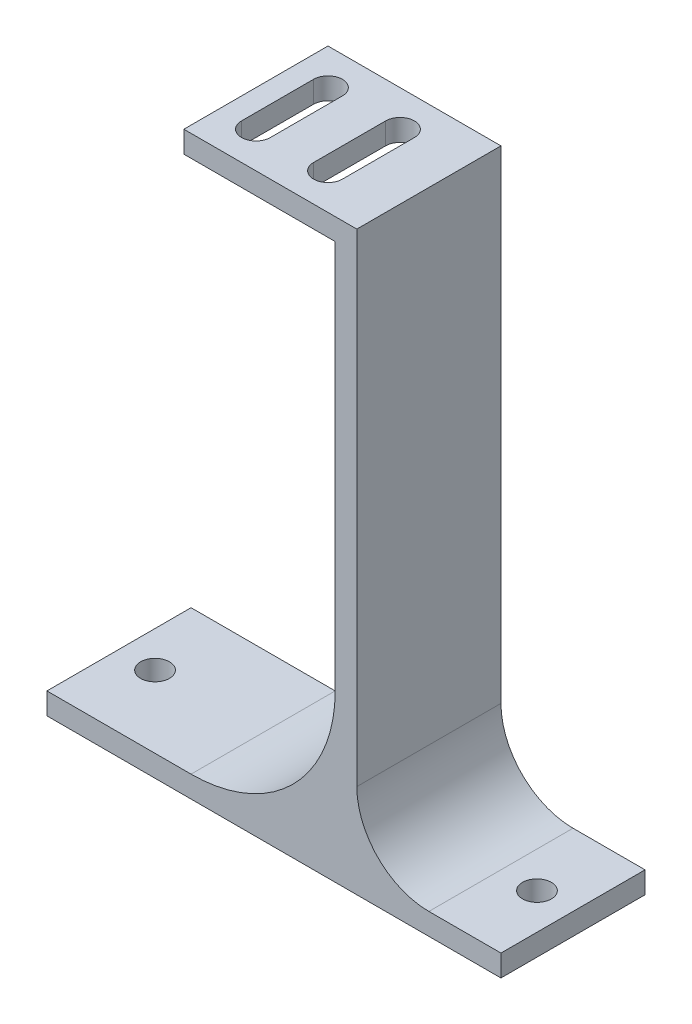
ISO-10303-21;
HEADER;
FILE_DESCRIPTION(('STEP AP214'),'2;1');
FILE_NAME('part.step','',(''),(''),'','','');
FILE_SCHEMA(('AUTOMOTIVE_DESIGN { 1 0 10303 214 1 1 1 1 }'));
ENDSEC;
DATA;
#1=APPLICATION_CONTEXT('core data for automotive mechanical design processes');
#2=APPLICATION_PROTOCOL_DEFINITION('international standard','automotive_design',2000,#1);
#3=PRODUCT_CONTEXT('',#1,'mechanical');
#4=PRODUCT('Part','Part','',(#3));
#5=PRODUCT_RELATED_PRODUCT_CATEGORY('part','',(#4));
#6=PRODUCT_DEFINITION_FORMATION('','',#4);
#7=PRODUCT_DEFINITION_CONTEXT('part definition',#1,'design');
#8=PRODUCT_DEFINITION('design','',#6,#7);
#9=PRODUCT_DEFINITION_SHAPE('','',#8);
#10=(LENGTH_UNIT() NAMED_UNIT(*) SI_UNIT(.MILLI.,.METRE.));
#11=(NAMED_UNIT(*) PLANE_ANGLE_UNIT() SI_UNIT($,.RADIAN.));
#12=(NAMED_UNIT(*) SI_UNIT($,.STERADIAN.) SOLID_ANGLE_UNIT());
#13=UNCERTAINTY_MEASURE_WITH_UNIT(LENGTH_MEASURE(1.E-05),#10,'distance_accuracy_value','');
#14=(GEOMETRIC_REPRESENTATION_CONTEXT(3) GLOBAL_UNCERTAINTY_ASSIGNED_CONTEXT((#13)) GLOBAL_UNIT_ASSIGNED_CONTEXT((#10,
#11,#12)) REPRESENTATION_CONTEXT('',''));
#15=CARTESIAN_POINT('',(0.,0.,0.));
#16=DIRECTION('',(0.,0.,1.));
#17=DIRECTION('',(1.,0.,0.));
#18=AXIS2_PLACEMENT_3D('',#15,#16,#17);
#19=CARTESIAN_POINT('',(0.,0.,20.));
#20=DIRECTION('',(1.,0.,0.));
#21=DIRECTION('',(0.,0.,-1.));
#22=AXIS2_PLACEMENT_3D('',#19,#20,#21);
#23=PLANE('',#22);
#24=DIRECTION('',(0.,-1.,0.));
#25=VECTOR('',#24,1.);
#26=CARTESIAN_POINT('',(0.,0.,0.));
#27=LINE('',#26,#25);
#28=CARTESIAN_POINT('',(0.,3.,0.));
#29=VERTEX_POINT('',#28);
#30=CARTESIAN_POINT('',(0.,0.,0.));
#31=VERTEX_POINT('',#30);
#32=EDGE_CURVE('E207',#29,#31,#27,.T.);
#33=ORIENTED_EDGE('',*,*,#32,.T.);
#34=DIRECTION('',(0.,0.,-1.));
#35=VECTOR('',#34,1.);
#36=CARTESIAN_POINT('',(0.,0.,20.));
#37=LINE('',#36,#35);
#38=CARTESIAN_POINT('',(0.,0.,20.));
#39=VERTEX_POINT('',#38);
#40=EDGE_CURVE('E303',#39,#31,#37,.T.);
#41=ORIENTED_EDGE('',*,*,#40,.F.);
#42=DIRECTION('',(0.,-1.,0.));
#43=VECTOR('',#42,1.);
#44=CARTESIAN_POINT('',(0.,0.,20.));
#45=LINE('',#44,#43);
#46=CARTESIAN_POINT('',(0.,3.,20.));
#47=VERTEX_POINT('',#46);
#48=EDGE_CURVE('E239',#47,#39,#45,.T.);
#49=ORIENTED_EDGE('',*,*,#48,.F.);
#50=DIRECTION('',(0.,0.,-1.));
#51=VECTOR('',#50,1.);
#52=CARTESIAN_POINT('',(0.,3.,20.));
#53=LINE('',#52,#51);
#54=EDGE_CURVE('E262',#47,#29,#53,.T.);
#55=ORIENTED_EDGE('',*,*,#54,.T.);
#56=EDGE_LOOP('',(#33,#41,#49,#55));
#57=FACE_BOUND('',#56,.T.);
#58=ADVANCED_FACE('F33',(#57),#23,.F.);
#59=CARTESIAN_POINT('',(0.,0.,20.));
#60=DIRECTION('',(0.,1.,0.));
#61=DIRECTION('',(0.,0.,1.));
#62=AXIS2_PLACEMENT_3D('',#59,#60,#61);
#63=PLANE('',#62);
#64=CARTESIAN_POINT('',(5.,0.,10.));
#65=DIRECTION('',(0.,1.,0.));
#66=DIRECTION('',(0.,0.,1.));
#67=AXIS2_PLACEMENT_3D('',#64,#65,#66);
#68=CIRCLE('',#67,2.);
#69=CARTESIAN_POINT('',(5.,0.,12.));
#70=VERTEX_POINT('',#69);
#71=EDGE_CURVE('E221',#70,#70,#68,.F.);
#72=ORIENTED_EDGE('',*,*,#71,.F.);
#73=EDGE_LOOP('',(#72));
#74=FACE_BOUND('',#73,.T.);
#75=CARTESIAN_POINT('',(58.,0.,10.));
#76=DIRECTION('',(0.,1.,0.));
#77=DIRECTION('',(0.,0.,1.));
#78=AXIS2_PLACEMENT_3D('',#75,#76,#77);
#79=CIRCLE('',#78,2.);
#80=CARTESIAN_POINT('',(58.,0.,12.));
#81=VERTEX_POINT('',#80);
#82=EDGE_CURVE('E427',#81,#81,#79,.F.);
#83=ORIENTED_EDGE('',*,*,#82,.F.);
#84=EDGE_LOOP('',(#83));
#85=FACE_BOUND('',#84,.T.);
#86=DIRECTION('',(1.,0.,0.));
#87=VECTOR('',#86,1.);
#88=CARTESIAN_POINT('',(0.,0.,0.));
#89=LINE('',#88,#87);
#90=CARTESIAN_POINT('',(63.,0.,0.));
#91=VERTEX_POINT('',#90);
#92=EDGE_CURVE('E265',#31,#91,#89,.T.);
#93=ORIENTED_EDGE('',*,*,#92,.T.);
#94=DIRECTION('',(0.,0.,-1.));
#95=VECTOR('',#94,1.);
#96=CARTESIAN_POINT('',(63.,0.,20.));
#97=LINE('',#96,#95);
#98=CARTESIAN_POINT('',(63.,0.,20.));
#99=VERTEX_POINT('',#98);
#100=EDGE_CURVE('E300',#99,#91,#97,.T.);
#101=ORIENTED_EDGE('',*,*,#100,.F.);
#102=DIRECTION('',(1.,0.,0.));
#103=VECTOR('',#102,1.);
#104=CARTESIAN_POINT('',(0.,0.,20.));
#105=LINE('',#104,#103);
#106=EDGE_CURVE('E242',#39,#99,#105,.T.);
#107=ORIENTED_EDGE('',*,*,#106,.F.);
#108=ORIENTED_EDGE('',*,*,#40,.T.);
#109=EDGE_LOOP('',(#93,#101,#107,#108));
#110=FACE_BOUND('',#109,.T.);
#111=ADVANCED_FACE('F353',(#74,#85,#110),#63,.F.);
#112=CARTESIAN_POINT('',(63.,0.,20.));
#113=DIRECTION('',(-1.,0.,0.));
#114=DIRECTION('',(0.,0.,1.));
#115=AXIS2_PLACEMENT_3D('',#112,#113,#114);
#116=PLANE('',#115);
#117=DIRECTION('',(0.,1.,0.));
#118=VECTOR('',#117,1.);
#119=CARTESIAN_POINT('',(63.,0.,0.));
#120=LINE('',#119,#118);
#121=CARTESIAN_POINT('',(63.,3.,0.));
#122=VERTEX_POINT('',#121);
#123=EDGE_CURVE('E267',#91,#122,#120,.T.);
#124=ORIENTED_EDGE('',*,*,#123,.T.);
#125=DIRECTION('',(0.,0.,-1.));
#126=VECTOR('',#125,1.);
#127=CARTESIAN_POINT('',(63.,3.,20.));
#128=LINE('',#127,#126);
#129=CARTESIAN_POINT('',(63.,3.,20.));
#130=VERTEX_POINT('',#129);
#131=EDGE_CURVE('E297',#130,#122,#128,.T.);
#132=ORIENTED_EDGE('',*,*,#131,.F.);
#133=DIRECTION('',(0.,1.,0.));
#134=VECTOR('',#133,1.);
#135=CARTESIAN_POINT('',(63.,0.,20.));
#136=LINE('',#135,#134);
#137=EDGE_CURVE('E245',#99,#130,#136,.T.);
#138=ORIENTED_EDGE('',*,*,#137,.F.);
#139=ORIENTED_EDGE('',*,*,#100,.T.);
#140=EDGE_LOOP('',(#124,#132,#138,#139));
#141=FACE_BOUND('',#140,.T.);
#142=ADVANCED_FACE('F359',(#141),#116,.F.);
#143=CARTESIAN_POINT('',(43.,3.,20.));
#144=DIRECTION('',(0.,-1.,0.));
#145=DIRECTION('',(1.,0.,0.));
#146=AXIS2_PLACEMENT_3D('',#143,#144,#145);
#147=PLANE('',#146);
#148=CARTESIAN_POINT('',(58.,3.,10.));
#149=DIRECTION('',(0.,1.,0.));
#150=DIRECTION('',(0.,0.,1.));
#151=AXIS2_PLACEMENT_3D('',#148,#149,#150);
#152=CIRCLE('',#151,2.);
#153=CARTESIAN_POINT('',(58.,3.,12.));
#154=VERTEX_POINT('',#153);
#155=EDGE_CURVE('E430',#154,#154,#152,.T.);
#156=ORIENTED_EDGE('',*,*,#155,.F.);
#157=EDGE_LOOP('',(#156));
#158=FACE_BOUND('',#157,.T.);
#159=DIRECTION('',(-1.,0.,0.));
#160=VECTOR('',#159,1.);
#161=CARTESIAN_POINT('',(43.,3.,0.));
#162=LINE('',#161,#160);
#163=CARTESIAN_POINT('',(53.,3.,0.));
#164=VERTEX_POINT('',#163);
#165=EDGE_CURVE('E269',#122,#164,#162,.T.);
#166=ORIENTED_EDGE('',*,*,#165,.T.);
#167=DIRECTION('',(0.,0.,-1.));
#168=VECTOR('',#167,1.);
#169=CARTESIAN_POINT('',(53.,3.,20.));
#170=LINE('',#169,#168);
#171=CARTESIAN_POINT('',(53.,3.,20.));
#172=VERTEX_POINT('',#171);
#173=EDGE_CURVE('E48',#164,#172,#170,.F.);
#174=ORIENTED_EDGE('',*,*,#173,.T.);
#175=DIRECTION('',(-1.,0.,0.));
#176=VECTOR('',#175,1.);
#177=CARTESIAN_POINT('',(43.,3.,20.));
#178=LINE('',#177,#176);
#179=EDGE_CURVE('E247',#130,#172,#178,.T.);
#180=ORIENTED_EDGE('',*,*,#179,.F.);
#181=ORIENTED_EDGE('',*,*,#131,.T.);
#182=EDGE_LOOP('',(#166,#174,#180,#181));
#183=FACE_BOUND('',#182,.T.);
#184=ADVANCED_FACE('F365',(#158,#183),#147,.F.);
#185=CARTESIAN_POINT('',(43.,3.,20.));
#186=DIRECTION('',(-1.,0.,0.));
#187=DIRECTION('',(0.,0.,1.));
#188=AXIS2_PLACEMENT_3D('',#185,#186,#187);
#189=PLANE('',#188);
#190=DIRECTION('',(0.,1.,0.));
#191=VECTOR('',#190,1.);
#192=CARTESIAN_POINT('',(43.,3.,20.));
#193=LINE('',#192,#191);
#194=CARTESIAN_POINT('',(43.,13.,20.));
#195=VERTEX_POINT('',#194);
#196=CARTESIAN_POINT('',(43.,80.,20.));
#197=VERTEX_POINT('',#196);
#198=EDGE_CURVE('E249',#195,#197,#193,.T.);
#199=ORIENTED_EDGE('',*,*,#198,.F.);
#200=DIRECTION('',(0.,0.,-1.));
#201=VECTOR('',#200,1.);
#202=CARTESIAN_POINT('',(43.,13.,0.));
#203=LINE('',#202,#201);
#204=CARTESIAN_POINT('',(43.,13.,0.));
#205=VERTEX_POINT('',#204);
#206=EDGE_CURVE('E315',#195,#205,#203,.T.);
#207=ORIENTED_EDGE('',*,*,#206,.T.);
#208=DIRECTION('',(0.,1.,0.));
#209=VECTOR('',#208,1.);
#210=CARTESIAN_POINT('',(43.,3.,0.));
#211=LINE('',#210,#209);
#212=CARTESIAN_POINT('',(43.,80.,0.));
#213=VERTEX_POINT('',#212);
#214=EDGE_CURVE('E271',#205,#213,#211,.T.);
#215=ORIENTED_EDGE('',*,*,#214,.T.);
#216=DIRECTION('',(0.,0.,-1.));
#217=VECTOR('',#216,1.);
#218=CARTESIAN_POINT('',(43.,80.,20.));
#219=LINE('',#218,#217);
#220=EDGE_CURVE('E294',#197,#213,#219,.T.);
#221=ORIENTED_EDGE('',*,*,#220,.F.);
#222=EDGE_LOOP('',(#199,#207,#215,#221));
#223=FACE_BOUND('',#222,.T.);
#224=ADVANCED_FACE('F321',(#223),#189,.F.);
#225=CARTESIAN_POINT('',(19.,80.,20.));
#226=DIRECTION('',(0.,-1.,0.));
#227=DIRECTION('',(0.,0.,-1.));
#228=AXIS2_PLACEMENT_3D('',#225,#226,#227);
#229=PLANE('',#228);
#230=DIRECTION('',(0.,0.,1.));
#231=VECTOR('',#230,1.);
#232=CARTESIAN_POINT('',(22.,80.,5.));
#233=LINE('',#232,#231);
#234=CARTESIAN_POINT('',(22.,80.,5.));
#235=VERTEX_POINT('',#234);
#236=CARTESIAN_POINT('',(22.,80.,15.));
#237=VERTEX_POINT('',#236);
#238=EDGE_CURVE('E186',#235,#237,#233,.T.);
#239=ORIENTED_EDGE('',*,*,#238,.F.);
#240=CARTESIAN_POINT('',(24.,80.,5.));
#241=DIRECTION('',(0.,1.,0.));
#242=DIRECTION('',(0.,0.,1.));
#243=AXIS2_PLACEMENT_3D('',#240,#241,#242);
#244=CIRCLE('',#243,2.);
#245=CARTESIAN_POINT('',(26.,80.,5.));
#246=VERTEX_POINT('',#245);
#247=EDGE_CURVE('E191',#246,#235,#244,.T.);
#248=ORIENTED_EDGE('',*,*,#247,.F.);
#249=DIRECTION('',(0.,0.,-1.));
#250=VECTOR('',#249,1.);
#251=CARTESIAN_POINT('',(26.,80.,5.));
#252=LINE('',#251,#250);
#253=CARTESIAN_POINT('',(26.,80.,15.));
#254=VERTEX_POINT('',#253);
#255=EDGE_CURVE('E196',#254,#246,#252,.T.);
#256=ORIENTED_EDGE('',*,*,#255,.F.);
#257=CARTESIAN_POINT('',(24.,80.,15.));
#258=DIRECTION('',(0.,1.,0.));
#259=DIRECTION('',(0.,0.,1.));
#260=AXIS2_PLACEMENT_3D('',#257,#258,#259);
#261=CIRCLE('',#260,2.);
#262=EDGE_CURVE('E175',#237,#254,#261,.T.);
#263=ORIENTED_EDGE('',*,*,#262,.F.);
#264=EDGE_LOOP('',(#239,#248,#256,#263));
#265=FACE_BOUND('',#264,.T.);
#266=DIRECTION('',(0.,0.,1.));
#267=VECTOR('',#266,1.);
#268=CARTESIAN_POINT('',(32.,80.,5.));
#269=LINE('',#268,#267);
#270=CARTESIAN_POINT('',(32.,80.,5.));
#271=VERTEX_POINT('',#270);
#272=CARTESIAN_POINT('',(32.,80.,15.));
#273=VERTEX_POINT('',#272);
#274=EDGE_CURVE('E220',#271,#273,#269,.T.);
#275=ORIENTED_EDGE('',*,*,#274,.F.);
#276=CARTESIAN_POINT('',(34.,80.,5.));
#277=DIRECTION('',(0.,1.,0.));
#278=DIRECTION('',(0.,0.,1.));
#279=AXIS2_PLACEMENT_3D('',#276,#277,#278);
#280=CIRCLE('',#279,1.99999999999999);
#281=CARTESIAN_POINT('',(36.,80.,5.));
#282=VERTEX_POINT('',#281);
#283=EDGE_CURVE('E218',#282,#271,#280,.T.);
#284=ORIENTED_EDGE('',*,*,#283,.F.);
#285=DIRECTION('',(0.,0.,-1.));
#286=VECTOR('',#285,1.);
#287=CARTESIAN_POINT('',(36.,80.,5.));
#288=LINE('',#287,#286);
#289=CARTESIAN_POINT('',(36.,80.,15.));
#290=VERTEX_POINT('',#289);
#291=EDGE_CURVE('E227',#290,#282,#288,.T.);
#292=ORIENTED_EDGE('',*,*,#291,.F.);
#293=CARTESIAN_POINT('',(34.,80.,15.));
#294=DIRECTION('',(0.,1.,0.));
#295=DIRECTION('',(0.,0.,1.));
#296=AXIS2_PLACEMENT_3D('',#293,#294,#295);
#297=CIRCLE('',#296,1.99999999999999);
#298=EDGE_CURVE('E224',#273,#290,#297,.T.);
#299=ORIENTED_EDGE('',*,*,#298,.F.);
#300=EDGE_LOOP('',(#275,#284,#292,#299));
#301=FACE_BOUND('',#300,.T.);
#302=DIRECTION('',(-1.,0.,0.));
#303=VECTOR('',#302,1.);
#304=CARTESIAN_POINT('',(19.,80.,0.));
#305=LINE('',#304,#303);
#306=CARTESIAN_POINT('',(19.,80.,0.));
#307=VERTEX_POINT('',#306);
#308=EDGE_CURVE('E273',#213,#307,#305,.T.);
#309=ORIENTED_EDGE('',*,*,#308,.T.);
#310=DIRECTION('',(0.,0.,-1.));
#311=VECTOR('',#310,1.);
#312=CARTESIAN_POINT('',(19.,80.,20.));
#313=LINE('',#312,#311);
#314=CARTESIAN_POINT('',(19.,80.,20.));
#315=VERTEX_POINT('',#314);
#316=EDGE_CURVE('E291',#315,#307,#313,.T.);
#317=ORIENTED_EDGE('',*,*,#316,.F.);
#318=DIRECTION('',(-1.,0.,0.));
#319=VECTOR('',#318,1.);
#320=CARTESIAN_POINT('',(19.,80.,20.));
#321=LINE('',#320,#319);
#322=EDGE_CURVE('E251',#197,#315,#321,.T.);
#323=ORIENTED_EDGE('',*,*,#322,.F.);
#324=ORIENTED_EDGE('',*,*,#220,.T.);
#325=EDGE_LOOP('',(#309,#317,#323,#324));
#326=FACE_BOUND('',#325,.T.);
#327=ADVANCED_FACE('F193',(#265,#301,#326),#229,.F.);
#328=CARTESIAN_POINT('',(19.,80.,20.));
#329=DIRECTION('',(1.,0.,0.));
#330=DIRECTION('',(0.,0.,-1.));
#331=AXIS2_PLACEMENT_3D('',#328,#329,#330);
#332=PLANE('',#331);
#333=DIRECTION('',(0.,-1.,0.));
#334=VECTOR('',#333,1.);
#335=CARTESIAN_POINT('',(19.,80.,0.));
#336=LINE('',#335,#334);
#337=CARTESIAN_POINT('',(19.,77.,0.));
#338=VERTEX_POINT('',#337);
#339=EDGE_CURVE('E275',#307,#338,#336,.T.);
#340=ORIENTED_EDGE('',*,*,#339,.T.);
#341=DIRECTION('',(0.,0.,-1.));
#342=VECTOR('',#341,1.);
#343=CARTESIAN_POINT('',(19.,77.,20.));
#344=LINE('',#343,#342);
#345=CARTESIAN_POINT('',(19.,77.,20.));
#346=VERTEX_POINT('',#345);
#347=EDGE_CURVE('E288',#346,#338,#344,.T.);
#348=ORIENTED_EDGE('',*,*,#347,.F.);
#349=DIRECTION('',(0.,-1.,0.));
#350=VECTOR('',#349,1.);
#351=CARTESIAN_POINT('',(19.,80.,20.));
#352=LINE('',#351,#350);
#353=EDGE_CURVE('E253',#315,#346,#352,.T.);
#354=ORIENTED_EDGE('',*,*,#353,.F.);
#355=ORIENTED_EDGE('',*,*,#316,.T.);
#356=EDGE_LOOP('',(#340,#348,#354,#355));
#357=FACE_BOUND('',#356,.T.);
#358=ADVANCED_FACE('F335',(#357),#332,.F.);
#359=CARTESIAN_POINT('',(40.,77.,20.));
#360=DIRECTION('',(0.,1.,0.));
#361=DIRECTION('',(-1.,0.,0.));
#362=AXIS2_PLACEMENT_3D('',#359,#360,#361);
#363=PLANE('',#362);
#364=DIRECTION('',(0.,0.,1.));
#365=VECTOR('',#364,1.);
#366=CARTESIAN_POINT('',(26.,77.,5.));
#367=LINE('',#366,#365);
#368=CARTESIAN_POINT('',(26.,77.,5.));
#369=VERTEX_POINT('',#368);
#370=CARTESIAN_POINT('',(26.,77.,15.));
#371=VERTEX_POINT('',#370);
#372=EDGE_CURVE('E438',#369,#371,#367,.T.);
#373=ORIENTED_EDGE('',*,*,#372,.F.);
#374=CARTESIAN_POINT('',(24.,77.,5.));
#375=DIRECTION('',(0.,1.,0.));
#376=DIRECTION('',(-1.,0.,0.));
#377=AXIS2_PLACEMENT_3D('',#374,#375,#376);
#378=CIRCLE('',#377,2.);
#379=CARTESIAN_POINT('',(22.,77.,5.));
#380=VERTEX_POINT('',#379);
#381=EDGE_CURVE('E208',#380,#369,#378,.F.);
#382=ORIENTED_EDGE('',*,*,#381,.F.);
#383=DIRECTION('',(0.,0.,-1.));
#384=VECTOR('',#383,1.);
#385=CARTESIAN_POINT('',(22.,77.,5.));
#386=LINE('',#385,#384);
#387=CARTESIAN_POINT('',(22.,77.,15.));
#388=VERTEX_POINT('',#387);
#389=EDGE_CURVE('E205',#388,#380,#386,.T.);
#390=ORIENTED_EDGE('',*,*,#389,.F.);
#391=CARTESIAN_POINT('',(24.,77.,15.));
#392=DIRECTION('',(0.,1.,0.));
#393=DIRECTION('',(-1.,0.,0.));
#394=AXIS2_PLACEMENT_3D('',#391,#392,#393);
#395=CIRCLE('',#394,2.);
#396=EDGE_CURVE('E178',#371,#388,#395,.F.);
#397=ORIENTED_EDGE('',*,*,#396,.F.);
#398=EDGE_LOOP('',(#373,#382,#390,#397));
#399=FACE_BOUND('',#398,.T.);
#400=DIRECTION('',(0.,0.,1.));
#401=VECTOR('',#400,1.);
#402=CARTESIAN_POINT('',(36.,77.,5.));
#403=LINE('',#402,#401);
#404=CARTESIAN_POINT('',(36.,77.,5.));
#405=VERTEX_POINT('',#404);
#406=CARTESIAN_POINT('',(36.,77.,15.));
#407=VERTEX_POINT('',#406);
#408=EDGE_CURVE('E212',#405,#407,#403,.T.);
#409=ORIENTED_EDGE('',*,*,#408,.F.);
#410=CARTESIAN_POINT('',(34.,77.,5.));
#411=DIRECTION('',(0.,1.,0.));
#412=DIRECTION('',(-1.,0.,0.));
#413=AXIS2_PLACEMENT_3D('',#410,#411,#412);
#414=CIRCLE('',#413,1.99999999999999);
#415=CARTESIAN_POINT('',(32.,77.,5.));
#416=VERTEX_POINT('',#415);
#417=EDGE_CURVE('E215',#416,#405,#414,.F.);
#418=ORIENTED_EDGE('',*,*,#417,.F.);
#419=DIRECTION('',(0.,0.,-1.));
#420=VECTOR('',#419,1.);
#421=CARTESIAN_POINT('',(32.,77.,5.));
#422=LINE('',#421,#420);
#423=CARTESIAN_POINT('',(32.,77.,15.));
#424=VERTEX_POINT('',#423);
#425=EDGE_CURVE('E217',#424,#416,#422,.T.);
#426=ORIENTED_EDGE('',*,*,#425,.F.);
#427=CARTESIAN_POINT('',(34.,77.,15.));
#428=DIRECTION('',(0.,1.,0.));
#429=DIRECTION('',(-1.,0.,0.));
#430=AXIS2_PLACEMENT_3D('',#427,#428,#429);
#431=CIRCLE('',#430,1.99999999999999);
#432=EDGE_CURVE('E209',#407,#424,#431,.F.);
#433=ORIENTED_EDGE('',*,*,#432,.F.);
#434=EDGE_LOOP('',(#409,#418,#426,#433));
#435=FACE_BOUND('',#434,.T.);
#436=DIRECTION('',(1.,0.,0.));
#437=VECTOR('',#436,1.);
#438=CARTESIAN_POINT('',(40.,77.,0.));
#439=LINE('',#438,#437);
#440=CARTESIAN_POINT('',(40.,77.,0.));
#441=VERTEX_POINT('',#440);
#442=EDGE_CURVE('E277',#338,#441,#439,.T.);
#443=ORIENTED_EDGE('',*,*,#442,.T.);
#444=DIRECTION('',(0.,0.,-1.));
#445=VECTOR('',#444,1.);
#446=CARTESIAN_POINT('',(40.,77.,20.));
#447=LINE('',#446,#445);
#448=CARTESIAN_POINT('',(40.,77.,20.));
#449=VERTEX_POINT('',#448);
#450=EDGE_CURVE('E285',#449,#441,#447,.T.);
#451=ORIENTED_EDGE('',*,*,#450,.F.);
#452=DIRECTION('',(1.,0.,0.));
#453=VECTOR('',#452,1.);
#454=CARTESIAN_POINT('',(40.,77.,20.));
#455=LINE('',#454,#453);
#456=EDGE_CURVE('E255',#346,#449,#455,.T.);
#457=ORIENTED_EDGE('',*,*,#456,.F.);
#458=ORIENTED_EDGE('',*,*,#347,.T.);
#459=EDGE_LOOP('',(#443,#451,#457,#458));
#460=FACE_BOUND('',#459,.T.);
#461=ADVANCED_FACE('F376',(#399,#435,#460),#363,.F.);
#462=CARTESIAN_POINT('',(40.,3.,20.));
#463=DIRECTION('',(1.,0.,0.));
#464=DIRECTION('',(0.,1.,0.));
#465=AXIS2_PLACEMENT_3D('',#462,#463,#464);
#466=PLANE('',#465);
#467=DIRECTION('',(0.,-1.,0.));
#468=VECTOR('',#467,1.);
#469=CARTESIAN_POINT('',(40.,3.,0.));
#470=LINE('',#469,#468);
#471=CARTESIAN_POINT('',(40.,23.,0.));
#472=VERTEX_POINT('',#471);
#473=EDGE_CURVE('E279',#441,#472,#470,.T.);
#474=ORIENTED_EDGE('',*,*,#473,.T.);
#475=DIRECTION('',(0.,0.,-1.));
#476=VECTOR('',#475,1.);
#477=CARTESIAN_POINT('',(40.,23.,20.));
#478=LINE('',#477,#476);
#479=CARTESIAN_POINT('',(40.,23.,20.));
#480=VERTEX_POINT('',#479);
#481=EDGE_CURVE('E309',#472,#480,#478,.F.);
#482=ORIENTED_EDGE('',*,*,#481,.T.);
#483=DIRECTION('',(0.,-1.,0.));
#484=VECTOR('',#483,1.);
#485=CARTESIAN_POINT('',(40.,3.,20.));
#486=LINE('',#485,#484);
#487=EDGE_CURVE('E257',#449,#480,#486,.T.);
#488=ORIENTED_EDGE('',*,*,#487,.F.);
#489=ORIENTED_EDGE('',*,*,#450,.T.);
#490=EDGE_LOOP('',(#474,#482,#488,#489));
#491=FACE_BOUND('',#490,.T.);
#492=ADVANCED_FACE('F379',(#491),#466,.F.);
#493=CARTESIAN_POINT('',(0.,3.,20.));
#494=DIRECTION('',(0.,-1.,0.));
#495=DIRECTION('',(0.,0.,-1.));
#496=AXIS2_PLACEMENT_3D('',#493,#494,#495);
#497=PLANE('',#496);
#498=CARTESIAN_POINT('',(5.,3.,10.));
#499=DIRECTION('',(0.,1.,0.));
#500=DIRECTION('',(0.,0.,1.));
#501=AXIS2_PLACEMENT_3D('',#498,#499,#500);
#502=CIRCLE('',#501,2.);
#503=CARTESIAN_POINT('',(5.,3.,12.));
#504=VERTEX_POINT('',#503);
#505=EDGE_CURVE('E432',#504,#504,#502,.T.);
#506=ORIENTED_EDGE('',*,*,#505,.F.);
#507=EDGE_LOOP('',(#506));
#508=FACE_BOUND('',#507,.T.);
#509=DIRECTION('',(-1.,0.,0.));
#510=VECTOR('',#509,1.);
#511=CARTESIAN_POINT('',(0.,3.,20.));
#512=LINE('',#511,#510);
#513=CARTESIAN_POINT('',(20.,3.,20.));
#514=VERTEX_POINT('',#513);
#515=EDGE_CURVE('E260',#514,#47,#512,.T.);
#516=ORIENTED_EDGE('',*,*,#515,.F.);
#517=DIRECTION('',(0.,0.,-1.));
#518=VECTOR('',#517,1.);
#519=CARTESIAN_POINT('',(20.,3.,0.));
#520=LINE('',#519,#518);
#521=CARTESIAN_POINT('',(20.,3.,0.));
#522=VERTEX_POINT('',#521);
#523=EDGE_CURVE('E306',#514,#522,#520,.T.);
#524=ORIENTED_EDGE('',*,*,#523,.T.);
#525=DIRECTION('',(-1.,0.,0.));
#526=VECTOR('',#525,1.);
#527=CARTESIAN_POINT('',(0.,3.,0.));
#528=LINE('',#527,#526);
#529=EDGE_CURVE('E243',#522,#29,#528,.T.);
#530=ORIENTED_EDGE('',*,*,#529,.T.);
#531=ORIENTED_EDGE('',*,*,#54,.F.);
#532=EDGE_LOOP('',(#516,#524,#530,#531));
#533=FACE_BOUND('',#532,.T.);
#534=ADVANCED_FACE('F383',(#508,#533),#497,.F.);
#535=CARTESIAN_POINT('',(0.,0.,20.));
#536=DIRECTION('',(0.,0.,-1.));
#537=DIRECTION('',(-1.,0.,0.));
#538=AXIS2_PLACEMENT_3D('',#535,#536,#537);
#539=PLANE('',#538);
#540=ORIENTED_EDGE('',*,*,#48,.T.);
#541=ORIENTED_EDGE('',*,*,#106,.T.);
#542=ORIENTED_EDGE('',*,*,#137,.T.);
#543=ORIENTED_EDGE('',*,*,#179,.T.);
#544=CARTESIAN_POINT('',(53.,13.,20.));
#545=DIRECTION('',(0.,0.,-1.));
#546=DIRECTION('',(-1.,0.,0.));
#547=AXIS2_PLACEMENT_3D('',#544,#545,#546);
#548=CIRCLE('',#547,10.);
#549=EDGE_CURVE('E11',#172,#195,#548,.T.);
#550=ORIENTED_EDGE('',*,*,#549,.T.);
#551=ORIENTED_EDGE('',*,*,#198,.T.);
#552=ORIENTED_EDGE('',*,*,#322,.T.);
#553=ORIENTED_EDGE('',*,*,#353,.T.);
#554=ORIENTED_EDGE('',*,*,#456,.T.);
#555=ORIENTED_EDGE('',*,*,#487,.T.);
#556=CARTESIAN_POINT('',(20.,23.,20.));
#557=DIRECTION('',(0.,0.,-1.));
#558=DIRECTION('',(-1.,0.,0.));
#559=AXIS2_PLACEMENT_3D('',#556,#557,#558);
#560=CIRCLE('',#559,20.);
#561=EDGE_CURVE('E313',#480,#514,#560,.T.);
#562=ORIENTED_EDGE('',*,*,#561,.T.);
#563=ORIENTED_EDGE('',*,*,#515,.T.);
#564=EDGE_LOOP('',(#540,#541,#542,#543,#550,#551,#552,#553,#554,#555,#562,#563));
#565=FACE_BOUND('',#564,.T.);
#566=ADVANCED_FACE('F339',(#565),#539,.F.);
#567=CARTESIAN_POINT('',(0.,0.,0.));
#568=DIRECTION('',(0.,0.,-1.));
#569=DIRECTION('',(-1.,0.,0.));
#570=AXIS2_PLACEMENT_3D('',#567,#568,#569);
#571=PLANE('',#570);
#572=ORIENTED_EDGE('',*,*,#32,.F.);
#573=ORIENTED_EDGE('',*,*,#529,.F.);
#574=CARTESIAN_POINT('',(20.,23.,0.));
#575=DIRECTION('',(0.,0.,-1.));
#576=DIRECTION('',(-1.,0.,0.));
#577=AXIS2_PLACEMENT_3D('',#574,#575,#576);
#578=CIRCLE('',#577,20.);
#579=EDGE_CURVE('E311',#522,#472,#578,.F.);
#580=ORIENTED_EDGE('',*,*,#579,.T.);
#581=ORIENTED_EDGE('',*,*,#473,.F.);
#582=ORIENTED_EDGE('',*,*,#442,.F.);
#583=ORIENTED_EDGE('',*,*,#339,.F.);
#584=ORIENTED_EDGE('',*,*,#308,.F.);
#585=ORIENTED_EDGE('',*,*,#214,.F.);
#586=CARTESIAN_POINT('',(53.,13.,0.));
#587=DIRECTION('',(0.,0.,-1.));
#588=DIRECTION('',(-1.,0.,0.));
#589=AXIS2_PLACEMENT_3D('',#586,#587,#588);
#590=CIRCLE('',#589,10.);
#591=EDGE_CURVE('E41',#205,#164,#590,.F.);
#592=ORIENTED_EDGE('',*,*,#591,.T.);
#593=ORIENTED_EDGE('',*,*,#165,.F.);
#594=ORIENTED_EDGE('',*,*,#123,.F.);
#595=ORIENTED_EDGE('',*,*,#92,.F.);
#596=EDGE_LOOP('',(#572,#573,#580,#581,#582,#583,#584,#585,#592,#593,#594,#595));
#597=FACE_BOUND('',#596,.T.);
#598=ADVANCED_FACE('F327',(#597),#571,.T.);
#599=CARTESIAN_POINT('',(34.,62.439780221439,5.));
#600=DIRECTION('',(0.,1.,0.));
#601=DIRECTION('',(0.,0.,1.));
#602=AXIS2_PLACEMENT_3D('',#599,#600,#601);
#603=CYLINDRICAL_SURFACE('',#602,1.99999999999999);
#604=ORIENTED_EDGE('',*,*,#417,.T.);
#605=DIRECTION('',(0.,1.,0.));
#606=VECTOR('',#605,1.);
#607=CARTESIAN_POINT('',(36.,62.439780221439,5.));
#608=LINE('',#607,#606);
#609=EDGE_CURVE('E213',#405,#282,#608,.T.);
#610=ORIENTED_EDGE('',*,*,#609,.T.);
#611=ORIENTED_EDGE('',*,*,#283,.T.);
#612=DIRECTION('',(0.,1.,0.));
#613=VECTOR('',#612,1.);
#614=CARTESIAN_POINT('',(32.,62.439780221439,5.));
#615=LINE('',#614,#613);
#616=EDGE_CURVE('E230',#416,#271,#615,.T.);
#617=ORIENTED_EDGE('',*,*,#616,.F.);
#618=EDGE_LOOP('',(#604,#610,#611,#617));
#619=FACE_BOUND('',#618,.T.);
#620=ADVANCED_FACE('F390',(#619),#603,.F.);
#621=CARTESIAN_POINT('',(36.,62.439780221439,5.));
#622=DIRECTION('',(1.,0.,0.));
#623=DIRECTION('',(0.,0.,-1.));
#624=AXIS2_PLACEMENT_3D('',#621,#622,#623);
#625=PLANE('',#624);
#626=ORIENTED_EDGE('',*,*,#408,.T.);
#627=DIRECTION('',(0.,1.,0.));
#628=VECTOR('',#627,1.);
#629=CARTESIAN_POINT('',(36.,62.439780221439,15.));
#630=LINE('',#629,#628);
#631=EDGE_CURVE('E232',#407,#290,#630,.T.);
#632=ORIENTED_EDGE('',*,*,#631,.T.);
#633=ORIENTED_EDGE('',*,*,#291,.T.);
#634=ORIENTED_EDGE('',*,*,#609,.F.);
#635=EDGE_LOOP('',(#626,#632,#633,#634));
#636=FACE_BOUND('',#635,.T.);
#637=ADVANCED_FACE('F395',(#636),#625,.F.);
#638=CARTESIAN_POINT('',(34.,62.439780221439,15.));
#639=DIRECTION('',(0.,1.,0.));
#640=DIRECTION('',(0.,0.,1.));
#641=AXIS2_PLACEMENT_3D('',#638,#639,#640);
#642=CYLINDRICAL_SURFACE('',#641,1.99999999999999);
#643=ORIENTED_EDGE('',*,*,#432,.T.);
#644=DIRECTION('',(0.,1.,0.));
#645=VECTOR('',#644,1.);
#646=CARTESIAN_POINT('',(32.,62.439780221439,15.));
#647=LINE('',#646,#645);
#648=EDGE_CURVE('E234',#424,#273,#647,.T.);
#649=ORIENTED_EDGE('',*,*,#648,.T.);
#650=ORIENTED_EDGE('',*,*,#298,.T.);
#651=ORIENTED_EDGE('',*,*,#631,.F.);
#652=EDGE_LOOP('',(#643,#649,#650,#651));
#653=FACE_BOUND('',#652,.T.);
#654=ADVANCED_FACE('F401',(#653),#642,.F.);
#655=CARTESIAN_POINT('',(32.,62.439780221439,5.));
#656=DIRECTION('',(-1.,0.,0.));
#657=DIRECTION('',(0.,0.,1.));
#658=AXIS2_PLACEMENT_3D('',#655,#656,#657);
#659=PLANE('',#658);
#660=ORIENTED_EDGE('',*,*,#425,.T.);
#661=ORIENTED_EDGE('',*,*,#616,.T.);
#662=ORIENTED_EDGE('',*,*,#274,.T.);
#663=ORIENTED_EDGE('',*,*,#648,.F.);
#664=EDGE_LOOP('',(#660,#661,#662,#663));
#665=FACE_BOUND('',#664,.T.);
#666=ADVANCED_FACE('F397',(#665),#659,.F.);
#667=CARTESIAN_POINT('',(24.,62.439780221439,5.));
#668=DIRECTION('',(0.,1.,0.));
#669=DIRECTION('',(0.,0.,1.));
#670=AXIS2_PLACEMENT_3D('',#667,#668,#669);
#671=CYLINDRICAL_SURFACE('',#670,2.);
#672=ORIENTED_EDGE('',*,*,#381,.T.);
#673=DIRECTION('',(0.,1.,0.));
#674=VECTOR('',#673,1.);
#675=CARTESIAN_POINT('',(26.,62.439780221439,5.));
#676=LINE('',#675,#674);
#677=EDGE_CURVE('E201',#369,#246,#676,.T.);
#678=ORIENTED_EDGE('',*,*,#677,.T.);
#679=ORIENTED_EDGE('',*,*,#247,.T.);
#680=DIRECTION('',(0.,1.,0.));
#681=VECTOR('',#680,1.);
#682=CARTESIAN_POINT('',(22.,62.439780221439,5.));
#683=LINE('',#682,#681);
#684=EDGE_CURVE('E182',#380,#235,#683,.T.);
#685=ORIENTED_EDGE('',*,*,#684,.F.);
#686=EDGE_LOOP('',(#672,#678,#679,#685));
#687=FACE_BOUND('',#686,.T.);
#688=ADVANCED_FACE('F400',(#687),#671,.F.);
#689=CARTESIAN_POINT('',(26.,62.439780221439,5.));
#690=DIRECTION('',(1.,0.,0.));
#691=DIRECTION('',(0.,0.,-1.));
#692=AXIS2_PLACEMENT_3D('',#689,#690,#691);
#693=PLANE('',#692);
#694=ORIENTED_EDGE('',*,*,#372,.T.);
#695=DIRECTION('',(0.,1.,0.));
#696=VECTOR('',#695,1.);
#697=CARTESIAN_POINT('',(26.,62.439780221439,15.));
#698=LINE('',#697,#696);
#699=EDGE_CURVE('E181',#371,#254,#698,.T.);
#700=ORIENTED_EDGE('',*,*,#699,.T.);
#701=ORIENTED_EDGE('',*,*,#255,.T.);
#702=ORIENTED_EDGE('',*,*,#677,.F.);
#703=EDGE_LOOP('',(#694,#700,#701,#702));
#704=FACE_BOUND('',#703,.T.);
#705=ADVANCED_FACE('F411',(#704),#693,.F.);
#706=CARTESIAN_POINT('',(24.,62.439780221439,15.));
#707=DIRECTION('',(0.,1.,0.));
#708=DIRECTION('',(0.,0.,1.));
#709=AXIS2_PLACEMENT_3D('',#706,#707,#708);
#710=CYLINDRICAL_SURFACE('',#709,2.);
#711=ORIENTED_EDGE('',*,*,#396,.T.);
#712=DIRECTION('',(0.,1.,0.));
#713=VECTOR('',#712,1.);
#714=CARTESIAN_POINT('',(22.,62.439780221439,15.));
#715=LINE('',#714,#713);
#716=EDGE_CURVE('E170',#388,#237,#715,.T.);
#717=ORIENTED_EDGE('',*,*,#716,.T.);
#718=ORIENTED_EDGE('',*,*,#262,.T.);
#719=ORIENTED_EDGE('',*,*,#699,.F.);
#720=EDGE_LOOP('',(#711,#717,#718,#719));
#721=FACE_BOUND('',#720,.T.);
#722=ADVANCED_FACE('F172',(#721),#710,.F.);
#723=CARTESIAN_POINT('',(22.,62.439780221439,5.));
#724=DIRECTION('',(-1.,0.,0.));
#725=DIRECTION('',(0.,0.,1.));
#726=AXIS2_PLACEMENT_3D('',#723,#724,#725);
#727=PLANE('',#726);
#728=ORIENTED_EDGE('',*,*,#389,.T.);
#729=ORIENTED_EDGE('',*,*,#684,.T.);
#730=ORIENTED_EDGE('',*,*,#238,.T.);
#731=ORIENTED_EDGE('',*,*,#716,.F.);
#732=EDGE_LOOP('',(#728,#729,#730,#731));
#733=FACE_BOUND('',#732,.T.);
#734=ADVANCED_FACE('F187',(#733),#727,.F.);
#735=CARTESIAN_POINT('',(20.,23.,20.));
#736=DIRECTION('',(0.,0.,1.));
#737=DIRECTION('',(1.,0.,0.));
#738=AXIS2_PLACEMENT_3D('',#735,#736,#737);
#739=CYLINDRICAL_SURFACE('',#738,20.);
#740=ORIENTED_EDGE('',*,*,#561,.F.);
#741=ORIENTED_EDGE('',*,*,#481,.F.);
#742=ORIENTED_EDGE('',*,*,#579,.F.);
#743=ORIENTED_EDGE('',*,*,#523,.F.);
#744=EDGE_LOOP('',(#740,#741,#742,#743));
#745=FACE_BOUND('',#744,.T.);
#746=ADVANCED_FACE('F343',(#745),#739,.F.);
#747=CARTESIAN_POINT('',(53.,13.,20.));
#748=DIRECTION('',(0.,0.,1.));
#749=DIRECTION('',(1.,0.,0.));
#750=AXIS2_PLACEMENT_3D('',#747,#748,#749);
#751=CYLINDRICAL_SURFACE('',#750,10.);
#752=ORIENTED_EDGE('',*,*,#549,.F.);
#753=ORIENTED_EDGE('',*,*,#173,.F.);
#754=ORIENTED_EDGE('',*,*,#591,.F.);
#755=ORIENTED_EDGE('',*,*,#206,.F.);
#756=EDGE_LOOP('',(#752,#753,#754,#755));
#757=FACE_BOUND('',#756,.T.);
#758=ADVANCED_FACE('F35',(#757),#751,.F.);
#759=CARTESIAN_POINT('',(5.,-5.65685424949239,10.));
#760=DIRECTION('',(0.,1.,0.));
#761=DIRECTION('',(0.,0.,1.));
#762=AXIS2_PLACEMENT_3D('',#759,#760,#761);
#763=CYLINDRICAL_SURFACE('',#762,2.);
#764=ORIENTED_EDGE('',*,*,#71,.T.);
#765=EDGE_LOOP('',(#764));
#766=FACE_BOUND('',#765,.T.);
#767=ORIENTED_EDGE('',*,*,#505,.T.);
#768=EDGE_LOOP('',(#767));
#769=FACE_BOUND('',#768,.T.);
#770=ADVANCED_FACE('F342',(#766,#769),#763,.F.);
#771=CARTESIAN_POINT('',(58.,-5.65685424949239,10.));
#772=DIRECTION('',(0.,1.,0.));
#773=DIRECTION('',(0.,0.,1.));
#774=AXIS2_PLACEMENT_3D('',#771,#772,#773);
#775=CYLINDRICAL_SURFACE('',#774,2.);
#776=ORIENTED_EDGE('',*,*,#82,.T.);
#777=EDGE_LOOP('',(#776));
#778=FACE_BOUND('',#777,.T.);
#779=ORIENTED_EDGE('',*,*,#155,.T.);
#780=EDGE_LOOP('',(#779));
#781=FACE_BOUND('',#780,.T.);
#782=ADVANCED_FACE('F348',(#778,#781),#775,.F.);
#783=CLOSED_SHELL('',(#58,#111,#142,#184,#224,#327,#358,#461,#492,#534,#566,#598,#620,#637,#654,
#666,#688,#705,#722,#734,#746,#758,#770,#782));
#784=MANIFOLD_SOLID_BREP('B2',#783);
#785=ADVANCED_BREP_SHAPE_REPRESENTATION('',(#18,#784),#14);
#786=SHAPE_DEFINITION_REPRESENTATION(#9,#785);
ENDSEC;
END-ISO-10303-21;
